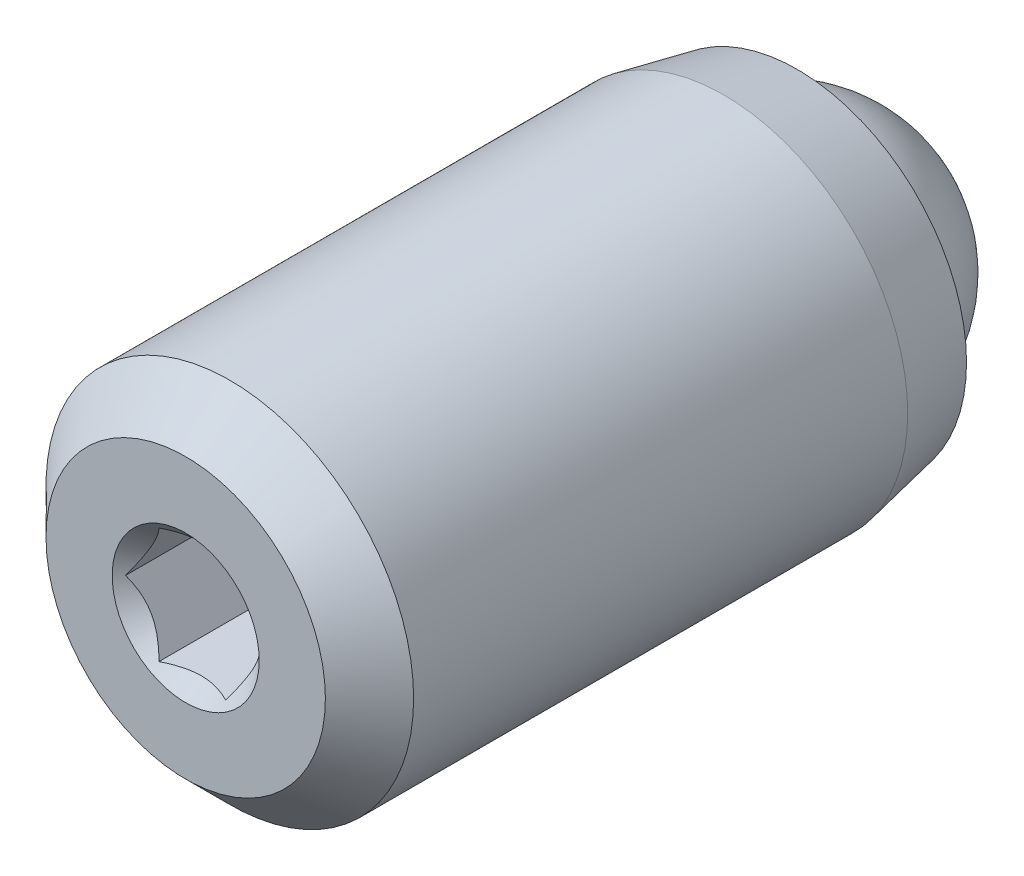
ISO-10303-21;
HEADER;
FILE_DESCRIPTION(('STEP AP214'),'2;1');
FILE_NAME('part.step','',(''),(''),'','','');
FILE_SCHEMA(('AUTOMOTIVE_DESIGN { 1 0 10303 214 1 1 1 1 }'));
ENDSEC;
DATA;
#1=APPLICATION_CONTEXT('core data for automotive mechanical design processes');
#2=APPLICATION_PROTOCOL_DEFINITION('international standard','automotive_design',2000,#1);
#3=PRODUCT_CONTEXT('',#1,'mechanical');
#4=PRODUCT('Part','Part','',(#3));
#5=PRODUCT_RELATED_PRODUCT_CATEGORY('part','',(#4));
#6=PRODUCT_DEFINITION_FORMATION('','',#4);
#7=PRODUCT_DEFINITION_CONTEXT('part definition',#1,'design');
#8=PRODUCT_DEFINITION('design','',#6,#7);
#9=PRODUCT_DEFINITION_SHAPE('','',#8);
#10=(LENGTH_UNIT() NAMED_UNIT(*) SI_UNIT(.MILLI.,.METRE.));
#11=(NAMED_UNIT(*) PLANE_ANGLE_UNIT() SI_UNIT($,.RADIAN.));
#12=(NAMED_UNIT(*) SI_UNIT($,.STERADIAN.) SOLID_ANGLE_UNIT());
#13=UNCERTAINTY_MEASURE_WITH_UNIT(LENGTH_MEASURE(1.E-05),#10,'distance_accuracy_value','');
#14=(GEOMETRIC_REPRESENTATION_CONTEXT(3) GLOBAL_UNCERTAINTY_ASSIGNED_CONTEXT((#13)) GLOBAL_UNIT_ASSIGNED_CONTEXT((#10,
#11,#12)) REPRESENTATION_CONTEXT('',''));
#15=CARTESIAN_POINT('',(0.,0.,0.));
#16=DIRECTION('',(0.,0.,1.));
#17=DIRECTION('',(1.,0.,0.));
#18=AXIS2_PLACEMENT_3D('',#15,#16,#17);
#19=CARTESIAN_POINT('',(9.74273900584421,-6.14099144723923,4.31418836824711));
#20=DIRECTION('',(0.,0.,-1.));
#21=DIRECTION('',(-1.,0.,0.));
#22=AXIS2_PLACEMENT_3D('',#19,#20,#21);
#23=PLANE('',#22);
#24=CARTESIAN_POINT('',(9.74273900584421,-6.14099144723923,4.31418836824711));
#25=DIRECTION('',(0.,0.,1.));
#26=DIRECTION('',(1.,0.,0.));
#27=AXIS2_PLACEMENT_3D('',#24,#25,#26);
#28=CIRCLE('',#27,1.27);
#29=CARTESIAN_POINT('',(11.0127390058442,-6.14099144723923,4.31418836824711));
#30=VERTEX_POINT('',#29);
#31=EDGE_CURVE('P0_E247',#30,#30,#28,.T.);
#32=ORIENTED_EDGE('',*,*,#31,.F.);
#33=EDGE_LOOP('',(#32));
#34=FACE_BOUND('',#33,.T.);
#35=CARTESIAN_POINT('',(9.74273900584421,-6.14099144723923,4.31418836824711));
#36=DIRECTION('',(0.,0.,1.));
#37=DIRECTION('',(1.,0.,0.));
#38=AXIS2_PLACEMENT_3D('',#35,#36,#37);
#39=CIRCLE('',#38,2.413);
#40=CARTESIAN_POINT('',(12.1557390058442,-6.14099144723923,4.31418836824711));
#41=VERTEX_POINT('',#40);
#42=EDGE_CURVE('P0_E162',#41,#41,#39,.T.);
#43=ORIENTED_EDGE('',*,*,#42,.T.);
#44=EDGE_LOOP('',(#43));
#45=FACE_BOUND('',#44,.T.);
#46=ADVANCED_FACE('P0_F17',(#34,#45),#23,.F.);
#47=CARTESIAN_POINT('',(9.74273900584421,-6.14099144723923,3.55218836824711));
#48=DIRECTION('',(0.,0.,-1.));
#49=DIRECTION('',(-1.,0.,0.));
#50=AXIS2_PLACEMENT_3D('',#47,#48,#49);
#51=CONICAL_SURFACE('',#50,3.175,0.785398163397448);
#52=ORIENTED_EDGE('',*,*,#42,.F.);
#53=EDGE_LOOP('',(#52));
#54=FACE_BOUND('',#53,.T.);
#55=CARTESIAN_POINT('',(9.74273900584421,-6.14099144723923,3.55218836824711));
#56=DIRECTION('',(0.,0.,1.));
#57=DIRECTION('',(1.,0.,0.));
#58=AXIS2_PLACEMENT_3D('',#55,#56,#57);
#59=CIRCLE('',#58,3.175);
#60=CARTESIAN_POINT('',(12.9177390058442,-6.14099144723923,3.55218836824711));
#61=VERTEX_POINT('',#60);
#62=EDGE_CURVE('P0_E160',#61,#61,#59,.T.);
#63=ORIENTED_EDGE('',*,*,#62,.T.);
#64=EDGE_LOOP('',(#63));
#65=FACE_BOUND('',#64,.T.);
#66=ADVANCED_FACE('P0_F311',(#54,#65),#51,.T.);
#67=CARTESIAN_POINT('',(9.74273900584421,-6.14099144723923,4.31418836824711));
#68=DIRECTION('',(0.,0.,1.));
#69=DIRECTION('',(1.,0.,0.));
#70=AXIS2_PLACEMENT_3D('',#67,#68,#69);
#71=CYLINDRICAL_SURFACE('',#70,3.175);
#72=ORIENTED_EDGE('',*,*,#62,.F.);
#73=EDGE_LOOP('',(#72));
#74=FACE_BOUND('',#73,.T.);
#75=CARTESIAN_POINT('',(9.74273900584421,-6.14099144723923,-4.98221163175289));
#76=DIRECTION('',(0.,0.,1.));
#77=DIRECTION('',(1.,0.,0.));
#78=AXIS2_PLACEMENT_3D('',#75,#76,#77);
#79=CIRCLE('',#78,3.175);
#80=CARTESIAN_POINT('',(12.9177390058442,-6.14099144723923,-4.98221163175289));
#81=VERTEX_POINT('',#80);
#82=EDGE_CURVE('P0_E157',#81,#81,#79,.T.);
#83=ORIENTED_EDGE('',*,*,#82,.T.);
#84=EDGE_LOOP('',(#83));
#85=FACE_BOUND('',#84,.T.);
#86=ADVANCED_FACE('P0_F316',(#74,#85),#71,.T.);
#87=CARTESIAN_POINT('',(9.74273900584421,-6.14099144723923,-6.25221163175289));
#88=DIRECTION('',(0.,0.,1.));
#89=DIRECTION('',(1.,0.,0.));
#90=AXIS2_PLACEMENT_3D('',#87,#88,#89);
#91=CONICAL_SURFACE('',#90,2.921,0.197395559849881);
#92=ORIENTED_EDGE('',*,*,#82,.F.);
#93=EDGE_LOOP('',(#92));
#94=FACE_BOUND('',#93,.T.);
#95=CARTESIAN_POINT('',(9.74273900584421,-6.14099144723923,-6.25221163175289));
#96=DIRECTION('',(0.,0.,1.));
#97=DIRECTION('',(1.,0.,0.));
#98=AXIS2_PLACEMENT_3D('',#95,#96,#97);
#99=CIRCLE('',#98,2.921);
#100=CARTESIAN_POINT('',(12.6637390058442,-6.14099144723923,-6.25221163175289));
#101=VERTEX_POINT('',#100);
#102=EDGE_CURVE('P0_E154',#101,#101,#99,.T.);
#103=ORIENTED_EDGE('',*,*,#102,.T.);
#104=EDGE_LOOP('',(#103));
#105=FACE_BOUND('',#104,.T.);
#106=ADVANCED_FACE('P0_F322',(#94,#105),#91,.T.);
#107=CARTESIAN_POINT('',(9.74273900584421,-3.21999144723923,-6.25221163175289));
#108=DIRECTION('',(0.,0.,1.));
#109=DIRECTION('',(1.,0.,0.));
#110=AXIS2_PLACEMENT_3D('',#107,#108,#109);
#111=PLANE('',#110);
#112=ORIENTED_EDGE('',*,*,#102,.F.);
#113=EDGE_LOOP('',(#112));
#114=FACE_BOUND('',#113,.T.);
#115=CARTESIAN_POINT('',(9.74273900584421,-6.14099144723923,-6.25221163175289));
#116=DIRECTION('',(0.,0.,1.));
#117=DIRECTION('',(1.,0.,0.));
#118=AXIS2_PLACEMENT_3D('',#115,#116,#117);
#119=CIRCLE('',#118,2.3876);
#120=CARTESIAN_POINT('',(12.1303390058442,-6.14099144723923,-6.25221163175289));
#121=VERTEX_POINT('',#120);
#122=EDGE_CURVE('P0_E151',#121,#121,#119,.T.);
#123=ORIENTED_EDGE('',*,*,#122,.T.);
#124=EDGE_LOOP('',(#123));
#125=FACE_BOUND('',#124,.T.);
#126=ADVANCED_FACE('P0_F329',(#114,#125),#111,.F.);
#127=CARTESIAN_POINT('',(9.74273900584421,-6.14099144723923,4.31418836824711));
#128=DIRECTION('',(0.,0.,1.));
#129=DIRECTION('',(1.,0.,0.));
#130=AXIS2_PLACEMENT_3D('',#127,#128,#129);
#131=CYLINDRICAL_SURFACE('',#130,2.3876);
#132=ORIENTED_EDGE('',*,*,#122,.F.);
#133=EDGE_LOOP('',(#132));
#134=FACE_BOUND('',#133,.T.);
#135=CARTESIAN_POINT('',(9.74273900584421,-6.14099144723923,-5.02456558635197));
#136=DIRECTION('',(0.,0.,1.));
#137=DIRECTION('',(1.,0.,0.));
#138=AXIS2_PLACEMENT_3D('',#135,#136,#137);
#139=CIRCLE('',#138,2.3876);
#140=CARTESIAN_POINT('',(12.1303390058442,-6.14099144723923,-5.02456558635197));
#141=VERTEX_POINT('',#140);
#142=EDGE_CURVE('P0_E148',#141,#141,#139,.T.);
#143=ORIENTED_EDGE('',*,*,#142,.T.);
#144=EDGE_LOOP('',(#143));
#145=FACE_BOUND('',#144,.T.);
#146=ADVANCED_FACE('P0_F333',(#134,#145),#131,.F.);
#147=CARTESIAN_POINT('',(9.74273900584421,-6.14099144723923,-2.63696558635194));
#148=DIRECTION('',(0.,0.,-1.));
#149=DIRECTION('',(-1.,0.,0.));
#150=AXIS2_PLACEMENT_3D('',#147,#148,#149);
#151=CONICAL_SURFACE('',#150,0.,0.785398163397443);
#152=ORIENTED_EDGE('',*,*,#142,.F.);
#153=EDGE_LOOP('',(#152));
#154=FACE_BOUND('',#153,.T.);
#155=CARTESIAN_POINT('',(9.74273900584421,-6.14099144723923,-2.63696558635194));
#156=VERTEX_POINT('',#155);
#157=VERTEX_LOOP('',#156);
#158=FACE_BOUND('',#157,.T.);
#159=ADVANCED_FACE('P0_F269',(#154,#158),#151,.F.);
#160=CARTESIAN_POINT('',(9.74273900584421,-6.14099144723923,3.04418836824709));
#161=DIRECTION('',(0.,0.,1.));
#162=DIRECTION('',(1.,0.,0.));
#163=AXIS2_PLACEMENT_3D('',#160,#161,#162);
#164=CONICAL_SURFACE('',#163,0.,0.785398163397443);
#165=ORIENTED_EDGE('',*,*,#31,.T.);
#166=EDGE_LOOP('',(#165));
#167=FACE_BOUND('',#166,.T.);
#168=CARTESIAN_POINT('',(10.8975550142773,-6.14079144723923,4.19900439399897));
#169=CARTESIAN_POINT('',(10.8777042137945,-6.17517404224641,4.17916683745209));
#170=CARTESIAN_POINT('',(10.8575214784036,-6.21013156537905,4.16049392726525));
#171=CARTESIAN_POINT('',(10.8163664011364,-6.28141425019532,4.12630364934952));
#172=CARTESIAN_POINT('',(10.795390141425,-6.31774619776821,4.11080531564982));
#173=CARTESIAN_POINT('',(10.7530923849422,-6.39100806104254,4.08425621376862));
#174=CARTESIAN_POINT('',(10.7317816719535,-6.42791929868464,4.07313868062328));
#175=CARTESIAN_POINT('',(10.6886912051269,-6.50255417655008,4.05600877240254));
#176=CARTESIAN_POINT('',(10.6669127684708,-6.54027553534786,4.04998360409303));
#177=CARTESIAN_POINT('',(10.6293803184842,-6.60528364565716,4.04454946159385));
#178=CARTESIAN_POINT('',(10.6136751365165,-6.6324858187674,4.04374584494309));
#179=CARTESIAN_POINT('',(10.5822951857071,-6.68683748790834,4.04509560604324));
#180=CARTESIAN_POINT('',(10.5666204243391,-6.7139869709941,4.04724963617355));
#181=CARTESIAN_POINT('',(10.5198199764436,-6.79504772456618,4.05800587875483));
#182=CARTESIAN_POINT('',(10.4889271969606,-6.84855558821765,4.07090346304171));
#183=CARTESIAN_POINT('',(10.4347071222639,-6.94246751238265,4.10202963722853));
#184=CARTESIAN_POINT('',(10.4111255631376,-6.98331197091106,4.11862670432819));
#185=CARTESIAN_POINT('',(10.3648860917779,-7.06340108462117,4.15601383131165));
#186=CARTESIAN_POINT('',(10.3422254554288,-7.10265045810967,4.17679024844376));
#187=CARTESIAN_POINT('',(10.31997380498,-7.14119144723923,4.19900439399897));
#188=B_SPLINE_CURVE_WITH_KNOTS('',3,(#168,#169,#170,#171,#172,#173,#174,#175,#176,#177,#178,
#179,#180,#181,#182,#183,#184,#185,#186,#187),.UNSPECIFIED.,.F.,.F.,(4,2,2,2,2,2,2,2,2,4),(0.,
0.133237676828557,0.267252229834487,0.399137076269296,0.530689603280762,0.62481486426384,
0.718960890149123,0.907306626112085,1.05710100361789,1.20641411519286),.UNSPECIFIED.);
#189=CARTESIAN_POINT('',(10.8974395442235,-6.14099144723923,4.19888890662636));
#190=VERTEX_POINT('',#189);
#191=CARTESIAN_POINT('',(10.3200892750338,-7.14099144723923,4.19888890662636));
#192=VERTEX_POINT('',#191);
#193=EDGE_CURVE('P0_E115',#190,#192,#188,.T.);
#194=ORIENTED_EDGE('',*,*,#193,.T.);
#195=CARTESIAN_POINT('',(8.51031050264178,-7.14099144723923,4.63128635372431));
#196=CARTESIAN_POINT('',(8.53998270076168,-7.14099144723923,4.6082484072783));
#197=CARTESIAN_POINT('',(8.56981104218133,-7.14099144723923,4.58541224539767));
#198=CARTESIAN_POINT('',(8.62984623000346,-7.14099144723923,4.54022912420729));
#199=CARTESIAN_POINT('',(8.66005316098693,-7.14099144723923,4.51788227739346));
#200=CARTESIAN_POINT('',(8.75178228815565,-7.14099144723923,4.45138534315059));
#201=CARTESIAN_POINT('',(8.81396452758707,-7.14099144723923,4.40813118503922));
#202=CARTESIAN_POINT('',(8.94491067802644,-7.14099144723923,4.32243125889816));
#203=CARTESIAN_POINT('',(9.0138370880217,-7.14099144723923,4.28023129139766));
#204=CARTESIAN_POINT('',(9.1552277602692,-7.14099144723923,4.20250206004232));
#205=CARTESIAN_POINT('',(9.2276789876563,-7.14099144723923,4.16695027043341));
#206=CARTESIAN_POINT('',(9.33568526371046,-7.14099144723923,4.12343424897431));
#207=CARTESIAN_POINT('',(9.36946583509232,-7.14099144723923,4.11109208210914));
#208=CARTESIAN_POINT('',(9.43791348520493,-7.14099144723923,4.08911273309591));
#209=CARTESIAN_POINT('',(9.47258061828307,-7.14099144723923,4.07947571721293));
#210=CARTESIAN_POINT('',(9.54196768302015,-7.14099144723923,4.06359667679777));
#211=CARTESIAN_POINT('',(9.57667273054637,-7.14099144723923,4.05729068819748));
#212=CARTESIAN_POINT('',(9.64655556321643,-7.14099144723923,4.04820649951787));
#213=CARTESIAN_POINT('',(9.68173339199748,-7.14099144723923,4.04542862737143));
#214=CARTESIAN_POINT('',(9.75049884638581,-7.14099144723923,4.04365606128879));
#215=CARTESIAN_POINT('',(9.78408198766287,-7.14099144723923,4.04448663999703));
#216=CARTESIAN_POINT('',(9.85098674621754,-7.14099144723923,4.04947664020862));
#217=CARTESIAN_POINT('',(9.88430842694802,-7.14099144723923,4.05363522712564));
#218=CARTESIAN_POINT('',(9.95103294348463,-7.14099144723923,4.06511190720631));
#219=CARTESIAN_POINT('',(9.9844257508201,-7.14099144723923,4.0724873543785));
#220=CARTESIAN_POINT('',(10.0504690645772,-7.14099144723923,4.08998167117632));
#221=CARTESIAN_POINT('',(10.0831196023826,-7.14099144723923,4.10010042457841));
#222=CARTESIAN_POINT('',(10.1825456951086,-7.14099144723923,4.13481096722407));
#223=CARTESIAN_POINT('',(10.2479876912246,-7.14099144723923,4.16320979591341));
#224=CARTESIAN_POINT('',(10.3758211422022,-7.14099144723923,4.2264268050646));
#225=CARTESIAN_POINT('',(10.4382009512613,-7.14099144723923,4.26126740155543));
#226=CARTESIAN_POINT('',(10.5574517880454,-7.14099144723923,4.33322605051449));
#227=CARTESIAN_POINT('',(10.6144428478589,-7.14099144723923,4.37014770752134));
#228=CARTESIAN_POINT('',(10.6984071950102,-7.14099144723923,4.42726054299713));
#229=CARTESIAN_POINT('',(10.7260346918042,-7.14099144723923,4.44650660504177));
#230=CARTESIAN_POINT('',(10.7809102254266,-7.14099144723923,4.48551716451218));
#231=CARTESIAN_POINT('',(10.8081583642475,-7.14099144723923,4.50528151830436));
#232=CARTESIAN_POINT('',(10.8352481880904,-7.14099144723923,4.52526105832419));
#233=B_SPLINE_CURVE_WITH_KNOTS('',3,(#195,#196,#197,#198,#199,#200,#201,#202,#203,#204,#205,
#206,#207,#208,#209,#210,#211,#212,#213,#214,#215,#216,#217,#218,#219,#220,#221,#222,#223,#224,
#225,#226,#227,#228,#229,#230,#231,#232),.UNSPECIFIED.,.F.,.F.,(4,2,2,2,2,2,2,2,2,2,2,2,2,2,2,2,
2,2,4),(0.,0.112694635133697,0.225414912901259,0.452565111221723,0.69484715433076,
0.936292788451031,1.04409719829335,1.15190823260368,1.25756594597726,1.36323347935069,
1.46384294190014,1.56442718186177,1.6668831555875,1.76933478931797,1.9827289310954,
2.19688011504817,2.40049475727374,2.50150167541717,2.60248089143825),.UNSPECIFIED.);
#234=CARTESIAN_POINT('',(9.16538873665459,-7.14099144723923,4.19888890662636));
#235=VERTEX_POINT('',#234);
#236=EDGE_CURVE('P0_E131',#192,#235,#233,.F.);
#237=ORIENTED_EDGE('',*,*,#236,.T.);
#238=CARTESIAN_POINT('',(9.16550420670843,-7.14119144723923,4.19900439399897));
#239=CARTESIAN_POINT('',(9.14565340622559,-7.10680885223205,4.17916683745209));
#240=CARTESIAN_POINT('',(9.12547067083476,-7.07185132909941,4.16049392726525));
#241=CARTESIAN_POINT('',(9.08431559356753,-7.00056864428314,4.12630364934951));
#242=CARTESIAN_POINT('',(9.06333933385613,-6.96423669671025,4.11080531564981));
#243=CARTESIAN_POINT('',(9.02104157737337,-6.89097483343592,4.08425621376862));
#244=CARTESIAN_POINT('',(8.99973086438458,-6.85406359579382,4.07313868062328));
#245=CARTESIAN_POINT('',(8.95664039755803,-6.77942871792838,4.05600877240254));
#246=CARTESIAN_POINT('',(8.93486196090194,-6.7417073591306,4.04998360409303));
#247=CARTESIAN_POINT('',(8.89732951091536,-6.6766992488213,4.04454946159385));
#248=CARTESIAN_POINT('',(8.88162432894762,-6.64949707571106,4.04374584494309));
#249=CARTESIAN_POINT('',(8.85024437813819,-6.59514540657012,4.04509560604324));
#250=CARTESIAN_POINT('',(8.83456961677027,-6.56799592348436,4.04724963617355));
#251=CARTESIAN_POINT('',(8.78776916887471,-6.48693516991228,4.05800587875482));
#252=CARTESIAN_POINT('',(8.75687638939177,-6.43342730626081,4.07090346304171));
#253=CARTESIAN_POINT('',(8.70265631469499,-6.33951538209581,4.10202963722853));
#254=CARTESIAN_POINT('',(8.67907475556871,-6.2986709235674,4.11862670432819));
#255=CARTESIAN_POINT('',(8.63283528420902,-6.21858180985729,4.15601383131165));
#256=CARTESIAN_POINT('',(8.61017464785992,-6.17933243636879,4.17679024844376));
#257=CARTESIAN_POINT('',(8.58792299741113,-6.14079144723923,4.19900439399897));
#258=B_SPLINE_CURVE_WITH_KNOTS('',3,(#238,#239,#240,#241,#242,#243,#244,#245,#246,#247,#248,
#249,#250,#251,#252,#253,#254,#255,#256,#257),.UNSPECIFIED.,.F.,.F.,(4,2,2,2,2,2,2,2,2,4),(0.,
0.133237676828558,0.267252229834487,0.399137076269296,0.530689603280762,0.624814864263839,
0.718960890149124,0.907306626112085,1.05710100361789,1.20641411519286),.UNSPECIFIED.);
#259=CARTESIAN_POINT('',(8.58803846746496,-6.14099144723923,4.19888890662636));
#260=VERTEX_POINT('',#259);
#261=EDGE_CURVE('P0_E249',#235,#260,#258,.T.);
#262=ORIENTED_EDGE('',*,*,#261,.T.);
#263=CARTESIAN_POINT('',(8.58792299741113,-6.14119144723923,4.19900439399897));
#264=CARTESIAN_POINT('',(8.60777379789396,-6.10680885223205,4.17916683745209));
#265=CARTESIAN_POINT('',(8.62795653328479,-6.07185132909941,4.16049392726525));
#266=CARTESIAN_POINT('',(8.66911161055202,-6.00056864428314,4.12630364934952));
#267=CARTESIAN_POINT('',(8.69008787026342,-5.96423669671025,4.11080531564982));
#268=CARTESIAN_POINT('',(8.73238562674618,-5.89097483343592,4.08425621376862));
#269=CARTESIAN_POINT('',(8.75369633973497,-5.85406359579382,4.07313868062328));
#270=CARTESIAN_POINT('',(8.79678680656152,-5.77942871792838,4.05600877240254));
#271=CARTESIAN_POINT('',(8.81856524321761,-5.7417073591306,4.04998360409303));
#272=CARTESIAN_POINT('',(8.8560976932042,-5.6766992488213,4.04454946159385));
#273=CARTESIAN_POINT('',(8.87180287517194,-5.64949707571106,4.04374584494309));
#274=CARTESIAN_POINT('',(8.90318282598136,-5.59514540657012,4.04509560604324));
#275=CARTESIAN_POINT('',(8.91885758734929,-5.56799592348436,4.04724963617355));
#276=CARTESIAN_POINT('',(8.96565803524484,-5.48693516991228,4.05800587875482));
#277=CARTESIAN_POINT('',(8.99655081472778,-5.43342730626081,4.07090346304171));
#278=CARTESIAN_POINT('',(9.05077088942456,-5.33951538209581,4.10202963722853));
#279=CARTESIAN_POINT('',(9.07435244855084,-5.2986709235674,4.11862670432819));
#280=CARTESIAN_POINT('',(9.12059191991053,-5.21858180985729,4.15601383131165));
#281=CARTESIAN_POINT('',(9.14325255625964,-5.17933243636879,4.17679024844376));
#282=CARTESIAN_POINT('',(9.16550420670843,-5.14079144723923,4.19900439399897));
#283=B_SPLINE_CURVE_WITH_KNOTS('',3,(#263,#264,#265,#266,#267,#268,#269,#270,#271,#272,#273,
#274,#275,#276,#277,#278,#279,#280,#281,#282),.UNSPECIFIED.,.F.,.F.,(4,2,2,2,2,2,2,2,2,4),(0.,
0.133237676828556,0.267252229834488,0.399137076269295,0.530689603280762,0.624814864263839,
0.718960890149123,0.907306626112083,1.05710100361789,1.20641411519286),.UNSPECIFIED.);
#284=CARTESIAN_POINT('',(9.16538873665459,-5.14099144723923,4.19888890662636));
#285=VERTEX_POINT('',#284);
#286=EDGE_CURVE('P0_E241',#260,#285,#283,.T.);
#287=ORIENTED_EDGE('',*,*,#286,.T.);
#288=CARTESIAN_POINT('',(8.51031050264178,-5.14099144723923,4.63128635372431));
#289=CARTESIAN_POINT('',(8.53998270076168,-5.14099144723923,4.6082484072783));
#290=CARTESIAN_POINT('',(8.56981104218133,-5.14099144723923,4.58541224539767));
#291=CARTESIAN_POINT('',(8.62984623000346,-5.14099144723923,4.54022912420729));
#292=CARTESIAN_POINT('',(8.66005316098693,-5.14099144723923,4.51788227739346));
#293=CARTESIAN_POINT('',(8.75178228815565,-5.14099144723923,4.45138534315059));
#294=CARTESIAN_POINT('',(8.81396452758707,-5.14099144723923,4.40813118503922));
#295=CARTESIAN_POINT('',(8.94491067802644,-5.14099144723923,4.32243125889816));
#296=CARTESIAN_POINT('',(9.01383708802169,-5.14099144723923,4.28023129139766));
#297=CARTESIAN_POINT('',(9.1552277602692,-5.14099144723923,4.20250206004232));
#298=CARTESIAN_POINT('',(9.2276789876563,-5.14099144723923,4.16695027043341));
#299=CARTESIAN_POINT('',(9.33568526371046,-5.14099144723923,4.12343424897431));
#300=CARTESIAN_POINT('',(9.36946583509232,-5.14099144723923,4.11109208210914));
#301=CARTESIAN_POINT('',(9.43791348520493,-5.14099144723923,4.08911273309591));
#302=CARTESIAN_POINT('',(9.47258061828307,-5.14099144723923,4.07947571721293));
#303=CARTESIAN_POINT('',(9.54196768302015,-5.14099144723923,4.06359667679777));
#304=CARTESIAN_POINT('',(9.57667273054637,-5.14099144723923,4.05729068819748));
#305=CARTESIAN_POINT('',(9.64655556321643,-5.14099144723923,4.04820649951787));
#306=CARTESIAN_POINT('',(9.68173339199748,-5.14099144723923,4.04542862737143));
#307=CARTESIAN_POINT('',(9.75049884638581,-5.14099144723923,4.04365606128879));
#308=CARTESIAN_POINT('',(9.78408198766287,-5.14099144723923,4.04448663999703));
#309=CARTESIAN_POINT('',(9.85098674621754,-5.14099144723923,4.04947664020862));
#310=CARTESIAN_POINT('',(9.88430842694802,-5.14099144723923,4.05363522712564));
#311=CARTESIAN_POINT('',(9.95103294348463,-5.14099144723923,4.06511190720631));
#312=CARTESIAN_POINT('',(9.9844257508201,-5.14099144723923,4.0724873543785));
#313=CARTESIAN_POINT('',(10.0504690645772,-5.14099144723923,4.08998167117632));
#314=CARTESIAN_POINT('',(10.0831196023826,-5.14099144723923,4.10010042457841));
#315=CARTESIAN_POINT('',(10.1825456951086,-5.14099144723923,4.13481096722407));
#316=CARTESIAN_POINT('',(10.2479876912246,-5.14099144723923,4.16320979591341));
#317=CARTESIAN_POINT('',(10.3758211422022,-5.14099144723923,4.2264268050646));
#318=CARTESIAN_POINT('',(10.4382009512613,-5.14099144723923,4.26126740155544));
#319=CARTESIAN_POINT('',(10.5574517880454,-5.14099144723923,4.3332260505145));
#320=CARTESIAN_POINT('',(10.6144428478589,-5.14099144723923,4.37014770752134));
#321=CARTESIAN_POINT('',(10.6984071950102,-5.14099144723923,4.42726054299713));
#322=CARTESIAN_POINT('',(10.7260346918042,-5.14099144723923,4.44650660504178));
#323=CARTESIAN_POINT('',(10.7809102254266,-5.14099144723923,4.48551716451218));
#324=CARTESIAN_POINT('',(10.8081583642475,-5.14099144723923,4.50528151830437));
#325=CARTESIAN_POINT('',(10.8352481880904,-5.14099144723923,4.52526105832419));
#326=B_SPLINE_CURVE_WITH_KNOTS('',3,(#288,#289,#290,#291,#292,#293,#294,#295,#296,#297,#298,
#299,#300,#301,#302,#303,#304,#305,#306,#307,#308,#309,#310,#311,#312,#313,#314,#315,#316,#317,
#318,#319,#320,#321,#322,#323,#324,#325),.UNSPECIFIED.,.F.,.F.,(4,2,2,2,2,2,2,2,2,2,2,2,2,2,2,2,
2,2,4),(0.,0.112694635133697,0.225414912901259,0.452565111221722,0.694847154330758,
0.936292788451031,1.04409719829335,1.15190823260368,1.25756594597726,1.36323347935069,
1.46384294190014,1.56442718186177,1.6668831555875,1.76933478931797,1.9827289310954,
2.19688011504817,2.40049475727374,2.50150167541718,2.60248089143825),.UNSPECIFIED.);
#327=CARTESIAN_POINT('',(10.3200892750338,-5.14099144723923,4.19888890662636));
#328=VERTEX_POINT('',#327);
#329=EDGE_CURVE('P0_E36',#285,#328,#326,.T.);
#330=ORIENTED_EDGE('',*,*,#329,.T.);
#331=CARTESIAN_POINT('',(10.31997380498,-5.14079144723923,4.19900439399897));
#332=CARTESIAN_POINT('',(10.3398246054628,-5.17517404224641,4.17916683745209));
#333=CARTESIAN_POINT('',(10.3600073408537,-5.21013156537905,4.16049392726525));
#334=CARTESIAN_POINT('',(10.4011624181209,-5.28141425019532,4.12630364934952));
#335=CARTESIAN_POINT('',(10.4221386778323,-5.31774619776821,4.11080531564982));
#336=CARTESIAN_POINT('',(10.4644364343151,-5.39100806104254,4.08425621376862));
#337=CARTESIAN_POINT('',(10.4857471473038,-5.42791929868464,4.07313868062328));
#338=CARTESIAN_POINT('',(10.5288376141304,-5.50255417655008,4.05600877240254));
#339=CARTESIAN_POINT('',(10.5506160507865,-5.54027553534786,4.04998360409303));
#340=CARTESIAN_POINT('',(10.5881485007731,-5.60528364565716,4.04454946159385));
#341=CARTESIAN_POINT('',(10.6038536827408,-5.6324858187674,4.04374584494309));
#342=CARTESIAN_POINT('',(10.6352336335502,-5.68683748790833,4.04509560604324));
#343=CARTESIAN_POINT('',(10.6509083949182,-5.7139869709941,4.04724963617355));
#344=CARTESIAN_POINT('',(10.6977088428137,-5.79504772456618,4.05800587875482));
#345=CARTESIAN_POINT('',(10.7286016222967,-5.84855558821765,4.07090346304171));
#346=CARTESIAN_POINT('',(10.7828216969934,-5.94246751238265,4.10202963722853));
#347=CARTESIAN_POINT('',(10.8064032561197,-5.98331197091106,4.11862670432819));
#348=CARTESIAN_POINT('',(10.8526427274794,-6.06340108462117,4.15601383131165));
#349=CARTESIAN_POINT('',(10.8753033638285,-6.10265045810967,4.17679024844376));
#350=CARTESIAN_POINT('',(10.8975550142773,-6.14119144723923,4.19900439399897));
#351=B_SPLINE_CURVE_WITH_KNOTS('',3,(#331,#332,#333,#334,#335,#336,#337,#338,#339,#340,#341,
#342,#343,#344,#345,#346,#347,#348,#349,#350),.UNSPECIFIED.,.F.,.F.,(4,2,2,2,2,2,2,2,2,4),(0.,
0.133237676828558,0.267252229834489,0.399137076269297,0.530689603280763,0.624814864263838,
0.718960890149123,0.907306626112084,1.05710100361789,1.20641411519286),.UNSPECIFIED.);
#352=EDGE_CURVE('P0_E11',#328,#190,#351,.T.);
#353=ORIENTED_EDGE('',*,*,#352,.T.);
#354=EDGE_LOOP('',(#194,#237,#262,#287,#330,#353));
#355=FACE_BOUND('',#354,.T.);
#356=ADVANCED_FACE('P0_F114',(#167,#355),#164,.F.);
#357=CARTESIAN_POINT('',(9.74273900584421,-6.14099144723923,0.351788368247108));
#358=DIRECTION('',(0.,0.,1.));
#359=DIRECTION('',(1.,0.,0.));
#360=AXIS2_PLACEMENT_3D('',#357,#358,#359);
#361=CONICAL_SURFACE('',#360,1.0414,1.02974425867665);
#362=CARTESIAN_POINT('',(9.74273900584421,-6.14099144723923,-0.273947880408193));
#363=VERTEX_POINT('',#362);
#364=VERTEX_LOOP('',#363);
#365=FACE_BOUND('',#364,.T.);
#366=CARTESIAN_POINT('',(9.74273900584421,-6.14099144723923,0.351788368247108));
#367=DIRECTION('',(0.,0.,1.));
#368=DIRECTION('',(1.,0.,0.));
#369=AXIS2_PLACEMENT_3D('',#366,#367,#368);
#370=CIRCLE('',#369,1.0414);
#371=CARTESIAN_POINT('',(10.7841390058442,-6.14099144723923,0.351788368247108));
#372=VERTEX_POINT('',#371);
#373=EDGE_CURVE('P0_E175',#372,#372,#370,.T.);
#374=ORIENTED_EDGE('',*,*,#373,.T.);
#375=EDGE_LOOP('',(#374));
#376=FACE_BOUND('',#375,.T.);
#377=ADVANCED_FACE('P0_F268',(#365,#376),#361,.F.);
#378=CARTESIAN_POINT('',(9.74273900584421,-6.14099144723923,1.26618836824711));
#379=DIRECTION('',(0.,0.,1.));
#380=DIRECTION('',(1.,0.,0.));
#381=AXIS2_PLACEMENT_3D('',#378,#379,#380);
#382=CYLINDRICAL_SURFACE('',#381,1.0414);
#383=ORIENTED_EDGE('',*,*,#373,.F.);
#384=EDGE_LOOP('',(#383));
#385=FACE_BOUND('',#384,.T.);
#386=CARTESIAN_POINT('',(9.74273900584421,-6.14099144723923,1.26618836824711));
#387=DIRECTION('',(0.,0.,1.));
#388=DIRECTION('',(1.,0.,0.));
#389=AXIS2_PLACEMENT_3D('',#386,#387,#388);
#390=CIRCLE('',#389,1.0414);
#391=CARTESIAN_POINT('',(10.7541208336353,-5.89275615882527,1.26618836824711));
#392=VERTEX_POINT('',#391);
#393=CARTESIAN_POINT('',(10.463407985622,-5.38922673565319,1.26618836824711));
#394=VERTEX_POINT('',#393);
#395=EDGE_CURVE('P0_E169',#392,#394,#390,.T.);
#396=ORIENTED_EDGE('',*,*,#395,.T.);
#397=CARTESIAN_POINT('',(10.0334518538575,-5.14099144723923,1.26618836824711));
#398=VERTEX_POINT('',#397);
#399=EDGE_CURVE('P0_E30',#394,#398,#390,.T.);
#400=ORIENTED_EDGE('',*,*,#399,.T.);
#401=CARTESIAN_POINT('',(9.45202615783092,-5.14099144723923,1.26618836824711));
#402=VERTEX_POINT('',#401);
#403=EDGE_CURVE('P0_E176',#398,#402,#390,.T.);
#404=ORIENTED_EDGE('',*,*,#403,.T.);
#405=CARTESIAN_POINT('',(9.02207002606642,-5.3892267356532,1.26618836824711));
#406=VERTEX_POINT('',#405);
#407=EDGE_CURVE('P0_E198',#402,#406,#390,.T.);
#408=ORIENTED_EDGE('',*,*,#407,.T.);
#409=CARTESIAN_POINT('',(8.73135717805313,-5.89275615882527,1.26618836824711));
#410=VERTEX_POINT('',#409);
#411=EDGE_CURVE('P0_E182',#406,#410,#390,.T.);
#412=ORIENTED_EDGE('',*,*,#411,.T.);
#413=CARTESIAN_POINT('',(8.73135717805313,-6.3892267356532,1.26618836824711));
#414=VERTEX_POINT('',#413);
#415=EDGE_CURVE('P0_E195',#410,#414,#390,.T.);
#416=ORIENTED_EDGE('',*,*,#415,.T.);
#417=CARTESIAN_POINT('',(9.02207002606642,-6.89275615882527,1.26618836824711));
#418=VERTEX_POINT('',#417);
#419=EDGE_CURVE('P0_E185',#414,#418,#390,.T.);
#420=ORIENTED_EDGE('',*,*,#419,.T.);
#421=CARTESIAN_POINT('',(9.45202615783092,-7.14099144723923,1.26618836824711));
#422=VERTEX_POINT('',#421);
#423=EDGE_CURVE('P0_E173',#418,#422,#390,.T.);
#424=ORIENTED_EDGE('',*,*,#423,.T.);
#425=CARTESIAN_POINT('',(10.0334518538575,-7.14099144723923,1.26618836824711));
#426=VERTEX_POINT('',#425);
#427=EDGE_CURVE('P0_E183',#422,#426,#390,.T.);
#428=ORIENTED_EDGE('',*,*,#427,.T.);
#429=CARTESIAN_POINT('',(10.463407985622,-6.89275615882526,1.26618836824711));
#430=VERTEX_POINT('',#429);
#431=EDGE_CURVE('P0_E167',#426,#430,#390,.T.);
#432=ORIENTED_EDGE('',*,*,#431,.T.);
#433=CARTESIAN_POINT('',(10.7541208336353,-6.3892267356532,1.26618836824711));
#434=VERTEX_POINT('',#433);
#435=EDGE_CURVE('P0_E44',#430,#434,#390,.T.);
#436=ORIENTED_EDGE('',*,*,#435,.T.);
#437=EDGE_CURVE('P0_E164',#434,#392,#390,.T.);
#438=ORIENTED_EDGE('',*,*,#437,.T.);
#439=EDGE_LOOP('',(#396,#400,#404,#408,#412,#416,#420,#424,#428,#432,#436,#438));
#440=FACE_BOUND('',#439,.T.);
#441=ADVANCED_FACE('P0_F194',(#385,#440),#382,.F.);
#442=CARTESIAN_POINT('',(10.7841390058442,-6.14099144723923,1.26618836824711));
#443=DIRECTION('',(0.,0.,1.));
#444=DIRECTION('',(1.,0.,0.));
#445=AXIS2_PLACEMENT_3D('',#442,#443,#444);
#446=PLANE('',#445);
#447=DIRECTION('',(0.5,0.866025403784439,0.));
#448=VECTOR('',#447,1.);
#449=CARTESIAN_POINT('',(10.3200892750338,-7.14099144723923,1.26618836824711));
#450=LINE('',#449,#448);
#451=EDGE_CURVE('P0_E400',#430,#434,#450,.T.);
#452=ORIENTED_EDGE('',*,*,#451,.T.);
#453=ORIENTED_EDGE('',*,*,#435,.F.);
#454=EDGE_LOOP('',(#452,#453));
#455=FACE_BOUND('',#454,.T.);
#456=ADVANCED_FACE('P0_F356',(#455),#446,.F.);
#457=DIRECTION('',(1.,0.,0.));
#458=VECTOR('',#457,1.);
#459=CARTESIAN_POINT('',(9.16538873665459,-7.14099144723923,1.26618836824711));
#460=LINE('',#459,#458);
#461=EDGE_CURVE('P0_E143',#422,#426,#460,.T.);
#462=ORIENTED_EDGE('',*,*,#461,.T.);
#463=ORIENTED_EDGE('',*,*,#427,.F.);
#464=EDGE_LOOP('',(#462,#463));
#465=FACE_BOUND('',#464,.T.);
#466=ADVANCED_FACE('P0_F365',(#465),#446,.F.);
#467=CARTESIAN_POINT('',(9.74273900584421,-6.14099144723923,1.26618836824711));
#468=DIRECTION('',(0.,0.,1.));
#469=DIRECTION('',(1.,0.,0.));
#470=AXIS2_PLACEMENT_3D('',#467,#468,#469);
#471=PLANE('',#470);
#472=ORIENTED_EDGE('',*,*,#431,.F.);
#473=CARTESIAN_POINT('',(10.3200892750338,-7.14099144723923,1.26618836824711));
#474=VERTEX_POINT('',#473);
#475=EDGE_CURVE('P0_E145',#426,#474,#460,.T.);
#476=ORIENTED_EDGE('',*,*,#475,.T.);
#477=EDGE_CURVE('P0_E401',#474,#430,#450,.T.);
#478=ORIENTED_EDGE('',*,*,#477,.T.);
#479=EDGE_LOOP('',(#472,#476,#478));
#480=FACE_BOUND('',#479,.T.);
#481=ADVANCED_FACE('P0_F360',(#480),#471,.T.);
#482=DIRECTION('',(0.5,-0.866025403784439,0.));
#483=VECTOR('',#482,1.);
#484=CARTESIAN_POINT('',(8.58803846746496,-6.14099144723923,1.26618836824711));
#485=LINE('',#484,#483);
#486=EDGE_CURVE('P0_E227',#414,#418,#485,.T.);
#487=ORIENTED_EDGE('',*,*,#486,.T.);
#488=ORIENTED_EDGE('',*,*,#419,.F.);
#489=EDGE_LOOP('',(#487,#488));
#490=FACE_BOUND('',#489,.T.);
#491=ADVANCED_FACE('P0_F364',(#490),#446,.F.);
#492=ORIENTED_EDGE('',*,*,#423,.F.);
#493=CARTESIAN_POINT('',(9.16538873665459,-7.14099144723923,1.26618836824711));
#494=VERTEX_POINT('',#493);
#495=EDGE_CURVE('P0_E225',#418,#494,#485,.T.);
#496=ORIENTED_EDGE('',*,*,#495,.T.);
#497=EDGE_CURVE('P0_E138',#494,#422,#460,.T.);
#498=ORIENTED_EDGE('',*,*,#497,.T.);
#499=EDGE_LOOP('',(#492,#496,#498));
#500=FACE_BOUND('',#499,.T.);
#501=ADVANCED_FACE('P0_F366',(#500),#471,.T.);
#502=DIRECTION('',(-0.5,-0.866025403784439,0.));
#503=VECTOR('',#502,1.);
#504=CARTESIAN_POINT('',(9.16538873665459,-5.14099144723923,1.26618836824711));
#505=LINE('',#504,#503);
#506=EDGE_CURVE('P0_E213',#406,#410,#505,.T.);
#507=ORIENTED_EDGE('',*,*,#506,.T.);
#508=ORIENTED_EDGE('',*,*,#411,.F.);
#509=EDGE_LOOP('',(#507,#508));
#510=FACE_BOUND('',#509,.T.);
#511=ADVANCED_FACE('P0_F372',(#510),#446,.F.);
#512=ORIENTED_EDGE('',*,*,#415,.F.);
#513=CARTESIAN_POINT('',(8.58803846746496,-6.14099144723923,1.26618836824711));
#514=VERTEX_POINT('',#513);
#515=EDGE_CURVE('P0_E205',#410,#514,#505,.T.);
#516=ORIENTED_EDGE('',*,*,#515,.T.);
#517=EDGE_CURVE('P0_E208',#514,#414,#485,.T.);
#518=ORIENTED_EDGE('',*,*,#517,.T.);
#519=EDGE_LOOP('',(#512,#516,#518));
#520=FACE_BOUND('',#519,.T.);
#521=ADVANCED_FACE('P0_F204',(#520),#471,.T.);
#522=DIRECTION('',(-1.,0.,0.));
#523=VECTOR('',#522,1.);
#524=CARTESIAN_POINT('',(10.3200892750338,-5.14099144723923,1.26618836824711));
#525=LINE('',#524,#523);
#526=EDGE_CURVE('P0_E221',#398,#402,#525,.T.);
#527=ORIENTED_EDGE('',*,*,#526,.T.);
#528=ORIENTED_EDGE('',*,*,#403,.F.);
#529=EDGE_LOOP('',(#527,#528));
#530=FACE_BOUND('',#529,.T.);
#531=ADVANCED_FACE('P0_F355',(#530),#446,.F.);
#532=ORIENTED_EDGE('',*,*,#407,.F.);
#533=CARTESIAN_POINT('',(9.16538873665459,-5.14099144723923,1.26618836824711));
#534=VERTEX_POINT('',#533);
#535=EDGE_CURVE('P0_E223',#402,#534,#525,.T.);
#536=ORIENTED_EDGE('',*,*,#535,.T.);
#537=EDGE_CURVE('P0_E219',#534,#406,#505,.T.);
#538=ORIENTED_EDGE('',*,*,#537,.T.);
#539=EDGE_LOOP('',(#532,#536,#538));
#540=FACE_BOUND('',#539,.T.);
#541=ADVANCED_FACE('P0_F350',(#540),#471,.T.);
#542=ORIENTED_EDGE('',*,*,#437,.F.);
#543=CARTESIAN_POINT('',(10.8974395442235,-6.14099144723923,1.26618836824711));
#544=VERTEX_POINT('',#543);
#545=EDGE_CURVE('P0_E180',#434,#544,#450,.T.);
#546=ORIENTED_EDGE('',*,*,#545,.T.);
#547=DIRECTION('',(-0.5,0.866025403784438,0.));
#548=VECTOR('',#547,1.);
#549=CARTESIAN_POINT('',(10.8974395442235,-6.14099144723923,1.26618836824711));
#550=LINE('',#549,#548);
#551=EDGE_CURVE('P0_E136',#544,#392,#550,.T.);
#552=ORIENTED_EDGE('',*,*,#551,.T.);
#553=EDGE_LOOP('',(#542,#546,#552));
#554=FACE_BOUND('',#553,.T.);
#555=ADVANCED_FACE('P0_F299',(#554),#471,.T.);
#556=EDGE_CURVE('P0_E405',#392,#394,#550,.T.);
#557=ORIENTED_EDGE('',*,*,#556,.T.);
#558=ORIENTED_EDGE('',*,*,#395,.F.);
#559=EDGE_LOOP('',(#557,#558));
#560=FACE_BOUND('',#559,.T.);
#561=ADVANCED_FACE('P0_F348',(#560),#446,.F.);
#562=ORIENTED_EDGE('',*,*,#399,.F.);
#563=CARTESIAN_POINT('',(10.3200892750338,-5.14099144723923,1.26618836824711));
#564=VERTEX_POINT('',#563);
#565=EDGE_CURVE('P0_E404',#394,#564,#550,.T.);
#566=ORIENTED_EDGE('',*,*,#565,.T.);
#567=EDGE_CURVE('P0_E217',#564,#398,#525,.T.);
#568=ORIENTED_EDGE('',*,*,#567,.T.);
#569=EDGE_LOOP('',(#562,#566,#568));
#570=FACE_BOUND('',#569,.T.);
#571=ADVANCED_FACE('P0_F344',(#570),#471,.T.);
#572=CARTESIAN_POINT('',(10.8974395442235,-6.14099144723923,1.26618836824711));
#573=DIRECTION('',(0.866025403784438,0.5,0.));
#574=DIRECTION('',(-0.5,0.866025403784438,0.));
#575=AXIS2_PLACEMENT_3D('',#572,#573,#574);
#576=PLANE('',#575);
#577=ORIENTED_EDGE('',*,*,#352,.F.);
#578=DIRECTION('',(0.,0.,1.));
#579=VECTOR('',#578,1.);
#580=CARTESIAN_POINT('',(10.3200892750338,-5.14099144723923,1.26618836824711));
#581=LINE('',#580,#579);
#582=EDGE_CURVE('P0_E137',#564,#328,#581,.T.);
#583=ORIENTED_EDGE('',*,*,#582,.F.);
#584=ORIENTED_EDGE('',*,*,#565,.F.);
#585=ORIENTED_EDGE('',*,*,#556,.F.);
#586=ORIENTED_EDGE('',*,*,#551,.F.);
#587=DIRECTION('',(0.,0.,1.));
#588=VECTOR('',#587,1.);
#589=CARTESIAN_POINT('',(10.8974395442235,-6.14099144723923,1.26618836824711));
#590=LINE('',#589,#588);
#591=EDGE_CURVE('P0_E126',#544,#190,#590,.T.);
#592=ORIENTED_EDGE('',*,*,#591,.T.);
#593=EDGE_LOOP('',(#577,#583,#584,#585,#586,#592));
#594=FACE_BOUND('',#593,.T.);
#595=ADVANCED_FACE('P0_F133',(#594),#576,.F.);
#596=CARTESIAN_POINT('',(10.3200892750338,-5.14099144723923,1.26618836824711));
#597=DIRECTION('',(0.,1.,0.));
#598=DIRECTION('',(0.,0.,1.));
#599=AXIS2_PLACEMENT_3D('',#596,#597,#598);
#600=PLANE('',#599);
#601=ORIENTED_EDGE('',*,*,#329,.F.);
#602=DIRECTION('',(0.,0.,1.));
#603=VECTOR('',#602,1.);
#604=CARTESIAN_POINT('',(9.16538873665459,-5.14099144723923,1.26618836824711));
#605=LINE('',#604,#603);
#606=EDGE_CURVE('P0_E140',#534,#285,#605,.T.);
#607=ORIENTED_EDGE('',*,*,#606,.F.);
#608=ORIENTED_EDGE('',*,*,#535,.F.);
#609=ORIENTED_EDGE('',*,*,#526,.F.);
#610=ORIENTED_EDGE('',*,*,#567,.F.);
#611=ORIENTED_EDGE('',*,*,#582,.T.);
#612=EDGE_LOOP('',(#601,#607,#608,#609,#610,#611));
#613=FACE_BOUND('',#612,.T.);
#614=ADVANCED_FACE('P0_F244',(#613),#600,.F.);
#615=CARTESIAN_POINT('',(9.16538873665459,-5.14099144723923,1.26618836824711));
#616=DIRECTION('',(-0.866025403784439,0.5,0.));
#617=DIRECTION('',(-0.5,-0.866025403784439,0.));
#618=AXIS2_PLACEMENT_3D('',#615,#616,#617);
#619=PLANE('',#618);
#620=ORIENTED_EDGE('',*,*,#286,.F.);
#621=DIRECTION('',(0.,0.,1.));
#622=VECTOR('',#621,1.);
#623=CARTESIAN_POINT('',(8.58803846746496,-6.14099144723923,1.26618836824711));
#624=LINE('',#623,#622);
#625=EDGE_CURVE('P0_E216',#514,#260,#624,.T.);
#626=ORIENTED_EDGE('',*,*,#625,.F.);
#627=ORIENTED_EDGE('',*,*,#515,.F.);
#628=ORIENTED_EDGE('',*,*,#506,.F.);
#629=ORIENTED_EDGE('',*,*,#537,.F.);
#630=ORIENTED_EDGE('',*,*,#606,.T.);
#631=EDGE_LOOP('',(#620,#626,#627,#628,#629,#630));
#632=FACE_BOUND('',#631,.T.);
#633=ADVANCED_FACE('P0_F211',(#632),#619,.F.);
#634=CARTESIAN_POINT('',(8.58803846746496,-6.14099144723923,1.26618836824711));
#635=DIRECTION('',(-0.866025403784439,-0.5,0.));
#636=DIRECTION('',(0.5,-0.866025403784439,0.));
#637=AXIS2_PLACEMENT_3D('',#634,#635,#636);
#638=PLANE('',#637);
#639=ORIENTED_EDGE('',*,*,#261,.F.);
#640=DIRECTION('',(0.,0.,1.));
#641=VECTOR('',#640,1.);
#642=CARTESIAN_POINT('',(9.16538873665459,-7.14099144723923,1.26618836824711));
#643=LINE('',#642,#641);
#644=EDGE_CURVE('P0_E236',#494,#235,#643,.T.);
#645=ORIENTED_EDGE('',*,*,#644,.F.);
#646=ORIENTED_EDGE('',*,*,#495,.F.);
#647=ORIENTED_EDGE('',*,*,#486,.F.);
#648=ORIENTED_EDGE('',*,*,#517,.F.);
#649=ORIENTED_EDGE('',*,*,#625,.T.);
#650=EDGE_LOOP('',(#639,#645,#646,#647,#648,#649));
#651=FACE_BOUND('',#650,.T.);
#652=ADVANCED_FACE('P0_F297',(#651),#638,.F.);
#653=CARTESIAN_POINT('',(9.16538873665459,-7.14099144723923,1.26618836824711));
#654=DIRECTION('',(0.,-1.,0.));
#655=DIRECTION('',(1.,0.,0.));
#656=AXIS2_PLACEMENT_3D('',#653,#654,#655);
#657=PLANE('',#656);
#658=ORIENTED_EDGE('',*,*,#236,.F.);
#659=DIRECTION('',(0.,0.,1.));
#660=VECTOR('',#659,1.);
#661=CARTESIAN_POINT('',(10.3200892750338,-7.14099144723923,1.26618836824711));
#662=LINE('',#661,#660);
#663=EDGE_CURVE('P0_E130',#474,#192,#662,.T.);
#664=ORIENTED_EDGE('',*,*,#663,.F.);
#665=ORIENTED_EDGE('',*,*,#475,.F.);
#666=ORIENTED_EDGE('',*,*,#461,.F.);
#667=ORIENTED_EDGE('',*,*,#497,.F.);
#668=ORIENTED_EDGE('',*,*,#644,.T.);
#669=EDGE_LOOP('',(#658,#664,#665,#666,#667,#668));
#670=FACE_BOUND('',#669,.T.);
#671=ADVANCED_FACE('P0_F293',(#670),#657,.F.);
#672=CARTESIAN_POINT('',(10.3200892750338,-7.14099144723923,1.26618836824711));
#673=DIRECTION('',(0.866025403784439,-0.5,0.));
#674=DIRECTION('',(0.5,0.866025403784439,0.));
#675=AXIS2_PLACEMENT_3D('',#672,#673,#674);
#676=PLANE('',#675);
#677=ORIENTED_EDGE('',*,*,#193,.F.);
#678=ORIENTED_EDGE('',*,*,#591,.F.);
#679=ORIENTED_EDGE('',*,*,#545,.F.);
#680=ORIENTED_EDGE('',*,*,#451,.F.);
#681=ORIENTED_EDGE('',*,*,#477,.F.);
#682=ORIENTED_EDGE('',*,*,#663,.T.);
#683=EDGE_LOOP('',(#677,#678,#679,#680,#681,#682));
#684=FACE_BOUND('',#683,.T.);
#685=ADVANCED_FACE('P0_F124',(#684),#676,.F.);
#686=CLOSED_SHELL('',(#46,#66,#86,#106,#126,#146,#159,#356,#377,#441,#456,#466,#481,#491,#501,
#511,#521,#531,#541,#555,#561,#571,#595,#614,#633,#652,#671,#685));
#687=MANIFOLD_SOLID_BREP('P0_B1',#686);
#688=CARTESIAN_POINT('',(9.74273900584421,-6.14099144723923,-6.00456163175289));
#689=DIRECTION('',(0.,1.,0.));
#690=DIRECTION('',(1.,0.,0.));
#691=AXIS2_PLACEMENT_3D('',#688,#689,#690);
#692=SPHERICAL_SURFACE('',#691,2.38125);
#693=CARTESIAN_POINT('',(9.74273900584421,-6.14099144723923,-6.00456163175289));
#694=DIRECTION('',(0.,0.,-1.));
#695=DIRECTION('',(1.,0.,0.));
#696=AXIS2_PLACEMENT_3D('',#693,#694,#695);
#697=SPHERICAL_SURFACE('',#696,2.38125);
#698=CARTESIAN_POINT('',(9.74273900584421,-6.14099144723923,-6.00456163175289));
#699=DIRECTION('',(0.,0.,-1.));
#700=DIRECTION('',(1.,0.,0.));
#701=AXIS2_PLACEMENT_3D('',#698,#699,#700);
#702=CIRCLE('',#701,2.38125);
#703=CARTESIAN_POINT('',(12.1239890058442,-6.14099144723923,-6.00456163175289));
#704=VERTEX_POINT('',#703);
#705=EDGE_CURVE('P1_E9',#704,#704,#702,.T.);
#706=ORIENTED_EDGE('',*,*,#705,.T.);
#707=EDGE_LOOP('',(#706));
#708=FACE_BOUND('',#707,.T.);
#709=ADVANCED_FACE('P1_F14',(#708),#697,.T.);
#710=CARTESIAN_POINT('',(9.74273900584421,-6.14099144723923,-6.00456163175289));
#711=DIRECTION('',(0.,0.,-1.));
#712=DIRECTION('',(1.,0.,0.));
#713=AXIS2_PLACEMENT_3D('',#710,#711,#712);
#714=SPHERICAL_SURFACE('',#713,2.38125);
#715=ORIENTED_EDGE('',*,*,#705,.F.);
#716=EDGE_LOOP('',(#715));
#717=FACE_BOUND('',#716,.T.);
#718=ADVANCED_FACE('P1_F16',(#717),#714,.T.);
#719=CLOSED_SHELL('',(#709,#718));
#720=MANIFOLD_SOLID_BREP('P1_B1',#719);
#721=ADVANCED_BREP_SHAPE_REPRESENTATION('',(#18,#687,#720),#14);
#722=SHAPE_DEFINITION_REPRESENTATION(#9,#721);
ENDSEC;
END-ISO-10303-21;
